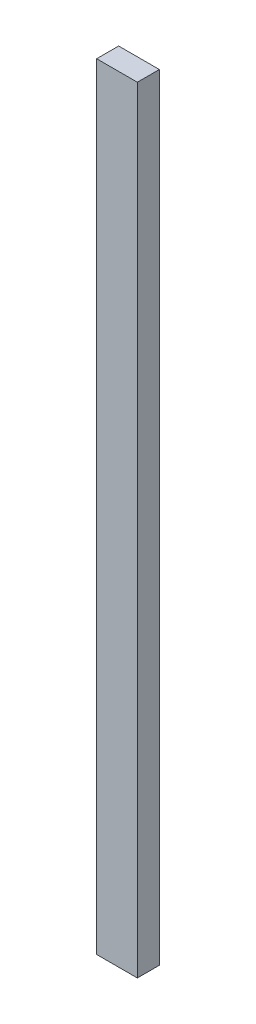
ISO-10303-21;
HEADER;
FILE_DESCRIPTION(('STEP AP214'),'2;1');
FILE_NAME('part.step','',(''),(''),'','','');
FILE_SCHEMA(('AUTOMOTIVE_DESIGN { 1 0 10303 214 1 1 1 1 }'));
ENDSEC;
DATA;
#1=APPLICATION_CONTEXT('core data for automotive mechanical design processes');
#2=APPLICATION_PROTOCOL_DEFINITION('international standard','automotive_design',2000,#1);
#3=PRODUCT_CONTEXT('',#1,'mechanical');
#4=PRODUCT('Part','Part','',(#3));
#5=PRODUCT_RELATED_PRODUCT_CATEGORY('part','',(#4));
#6=PRODUCT_DEFINITION_FORMATION('','',#4);
#7=PRODUCT_DEFINITION_CONTEXT('part definition',#1,'design');
#8=PRODUCT_DEFINITION('design','',#6,#7);
#9=PRODUCT_DEFINITION_SHAPE('','',#8);
#10=(LENGTH_UNIT() NAMED_UNIT(*) SI_UNIT(.MILLI.,.METRE.));
#11=(NAMED_UNIT(*) PLANE_ANGLE_UNIT() SI_UNIT($,.RADIAN.));
#12=(NAMED_UNIT(*) SI_UNIT($,.STERADIAN.) SOLID_ANGLE_UNIT());
#13=UNCERTAINTY_MEASURE_WITH_UNIT(LENGTH_MEASURE(1.E-05),#10,'distance_accuracy_value','');
#14=(GEOMETRIC_REPRESENTATION_CONTEXT(3) GLOBAL_UNCERTAINTY_ASSIGNED_CONTEXT((#13)) GLOBAL_UNIT_ASSIGNED_CONTEXT((#10,
#11,#12)) REPRESENTATION_CONTEXT('',''));
#15=CARTESIAN_POINT('',(0.,0.,0.));
#16=DIRECTION('',(0.,0.,1.));
#17=DIRECTION('',(1.,0.,0.));
#18=AXIS2_PLACEMENT_3D('',#15,#16,#17);
#19=CARTESIAN_POINT('',(-41.4226910768773,2000.,-17.1817593212771));
#20=DIRECTION('',(1.,0.,0.));
#21=DIRECTION('',(0.,0.,-1.));
#22=AXIS2_PLACEMENT_3D('',#19,#20,#21);
#23=PLANE('',#22);
#24=DIRECTION('',(0.,0.,1.));
#25=VECTOR('',#24,1.);
#26=CARTESIAN_POINT('',(-41.4226910768773,0.,-17.1817593212771));
#27=LINE('',#26,#25);
#28=CARTESIAN_POINT('',(-41.4226910768773,0.,-17.1817593212771));
#29=VERTEX_POINT('',#28);
#30=CARTESIAN_POINT('',(-41.4226910768773,0.,39.5580040187542));
#31=VERTEX_POINT('',#30);
#32=EDGE_CURVE('E111',#29,#31,#27,.T.);
#33=ORIENTED_EDGE('',*,*,#32,.T.);
#34=DIRECTION('',(0.,-1.,0.));
#35=VECTOR('',#34,1.);
#36=CARTESIAN_POINT('',(-41.4226910768773,2000.,39.5580040187542));
#37=LINE('',#36,#35);
#38=CARTESIAN_POINT('',(-41.4226910768773,2000.,39.5580040187542));
#39=VERTEX_POINT('',#38);
#40=EDGE_CURVE('E11',#39,#31,#37,.T.);
#41=ORIENTED_EDGE('',*,*,#40,.F.);
#42=DIRECTION('',(0.,0.,1.));
#43=VECTOR('',#42,1.);
#44=CARTESIAN_POINT('',(-41.4226910768773,2000.,-17.1817593212771));
#45=LINE('',#44,#43);
#46=CARTESIAN_POINT('',(-41.4226910768773,2000.,-17.1817593212771));
#47=VERTEX_POINT('',#46);
#48=EDGE_CURVE('E95',#47,#39,#45,.T.);
#49=ORIENTED_EDGE('',*,*,#48,.F.);
#50=DIRECTION('',(0.,-1.,0.));
#51=VECTOR('',#50,1.);
#52=CARTESIAN_POINT('',(-41.4226910768773,2000.,-17.1817593212771));
#53=LINE('',#52,#51);
#54=EDGE_CURVE('E107',#47,#29,#53,.T.);
#55=ORIENTED_EDGE('',*,*,#54,.T.);
#56=EDGE_LOOP('',(#33,#41,#49,#55));
#57=FACE_BOUND('',#56,.T.);
#58=ADVANCED_FACE('F43',(#57),#23,.F.);
#59=CARTESIAN_POINT('',(-41.4226910768773,2000.,39.5580040187542));
#60=DIRECTION('',(0.,0.,-1.));
#61=DIRECTION('',(-1.,0.,0.));
#62=AXIS2_PLACEMENT_3D('',#59,#60,#61);
#63=PLANE('',#62);
#64=DIRECTION('',(1.,0.,0.));
#65=VECTOR('',#64,1.);
#66=CARTESIAN_POINT('',(-41.4226910768773,0.,39.5580040187542));
#67=LINE('',#66,#65);
#68=CARTESIAN_POINT('',(63.5325519089082,0.,39.5580040187542));
#69=VERTEX_POINT('',#68);
#70=EDGE_CURVE('E100',#31,#69,#67,.T.);
#71=ORIENTED_EDGE('',*,*,#70,.T.);
#72=DIRECTION('',(0.,-1.,0.));
#73=VECTOR('',#72,1.);
#74=CARTESIAN_POINT('',(63.5325519089082,2000.,39.5580040187542));
#75=LINE('',#74,#73);
#76=CARTESIAN_POINT('',(63.5325519089082,2000.,39.5580040187542));
#77=VERTEX_POINT('',#76);
#78=EDGE_CURVE('E52',#77,#69,#75,.T.);
#79=ORIENTED_EDGE('',*,*,#78,.F.);
#80=DIRECTION('',(1.,0.,0.));
#81=VECTOR('',#80,1.);
#82=CARTESIAN_POINT('',(-41.4226910768773,2000.,39.5580040187542));
#83=LINE('',#82,#81);
#84=EDGE_CURVE('E90',#39,#77,#83,.T.);
#85=ORIENTED_EDGE('',*,*,#84,.F.);
#86=ORIENTED_EDGE('',*,*,#40,.T.);
#87=EDGE_LOOP('',(#71,#79,#85,#86));
#88=FACE_BOUND('',#87,.T.);
#89=ADVANCED_FACE('F99',(#88),#63,.F.);
#90=CARTESIAN_POINT('',(63.5325519089082,2000.,-17.1817593212771));
#91=DIRECTION('',(-1.,0.,0.));
#92=DIRECTION('',(0.,0.,1.));
#93=AXIS2_PLACEMENT_3D('',#90,#91,#92);
#94=PLANE('',#93);
#95=DIRECTION('',(0.,0.,-1.));
#96=VECTOR('',#95,1.);
#97=CARTESIAN_POINT('',(63.5325519089082,0.,-17.1817593212771));
#98=LINE('',#97,#96);
#99=CARTESIAN_POINT('',(63.5325519089082,0.,-17.1817593212771));
#100=VERTEX_POINT('',#99);
#101=EDGE_CURVE('E77',#69,#100,#98,.T.);
#102=ORIENTED_EDGE('',*,*,#101,.T.);
#103=DIRECTION('',(0.,-1.,0.));
#104=VECTOR('',#103,1.);
#105=CARTESIAN_POINT('',(63.5325519089082,2000.,-17.1817593212771));
#106=LINE('',#105,#104);
#107=CARTESIAN_POINT('',(63.5325519089082,2000.,-17.1817593212771));
#108=VERTEX_POINT('',#107);
#109=EDGE_CURVE('E102',#108,#100,#106,.T.);
#110=ORIENTED_EDGE('',*,*,#109,.F.);
#111=DIRECTION('',(0.,0.,-1.));
#112=VECTOR('',#111,1.);
#113=CARTESIAN_POINT('',(63.5325519089082,2000.,-17.1817593212771));
#114=LINE('',#113,#112);
#115=EDGE_CURVE('E93',#77,#108,#114,.T.);
#116=ORIENTED_EDGE('',*,*,#115,.F.);
#117=ORIENTED_EDGE('',*,*,#78,.T.);
#118=EDGE_LOOP('',(#102,#110,#116,#117));
#119=FACE_BOUND('',#118,.T.);
#120=ADVANCED_FACE('F103',(#119),#94,.F.);
#121=CARTESIAN_POINT('',(-41.4226910768773,2000.,-17.1817593212771));
#122=DIRECTION('',(0.,0.,1.));
#123=DIRECTION('',(1.,0.,0.));
#124=AXIS2_PLACEMENT_3D('',#121,#122,#123);
#125=PLANE('',#124);
#126=DIRECTION('',(-1.,0.,0.));
#127=VECTOR('',#126,1.);
#128=CARTESIAN_POINT('',(-41.4226910768773,0.,-17.1817593212771));
#129=LINE('',#128,#127);
#130=EDGE_CURVE('E83',#100,#29,#129,.T.);
#131=ORIENTED_EDGE('',*,*,#130,.T.);
#132=ORIENTED_EDGE('',*,*,#54,.F.);
#133=DIRECTION('',(-1.,0.,0.));
#134=VECTOR('',#133,1.);
#135=CARTESIAN_POINT('',(-41.4226910768773,2000.,-17.1817593212771));
#136=LINE('',#135,#134);
#137=EDGE_CURVE('E60',#108,#47,#136,.T.);
#138=ORIENTED_EDGE('',*,*,#137,.F.);
#139=ORIENTED_EDGE('',*,*,#109,.T.);
#140=EDGE_LOOP('',(#131,#132,#138,#139));
#141=FACE_BOUND('',#140,.T.);
#142=ADVANCED_FACE('F124',(#141),#125,.F.);
#143=CARTESIAN_POINT('',(0.,2000.,0.));
#144=DIRECTION('',(0.,1.,0.));
#145=DIRECTION('',(0.,0.,1.));
#146=AXIS2_PLACEMENT_3D('',#143,#144,#145);
#147=PLANE('',#146);
#148=ORIENTED_EDGE('',*,*,#48,.T.);
#149=ORIENTED_EDGE('',*,*,#84,.T.);
#150=ORIENTED_EDGE('',*,*,#115,.T.);
#151=ORIENTED_EDGE('',*,*,#137,.T.);
#152=EDGE_LOOP('',(#148,#149,#150,#151));
#153=FACE_BOUND('',#152,.T.);
#154=ADVANCED_FACE('F91',(#153),#147,.T.);
#155=CARTESIAN_POINT('',(0.,0.,0.));
#156=DIRECTION('',(0.,1.,0.));
#157=DIRECTION('',(0.,0.,1.));
#158=AXIS2_PLACEMENT_3D('',#155,#156,#157);
#159=PLANE('',#158);
#160=ORIENTED_EDGE('',*,*,#32,.F.);
#161=ORIENTED_EDGE('',*,*,#130,.F.);
#162=ORIENTED_EDGE('',*,*,#101,.F.);
#163=ORIENTED_EDGE('',*,*,#70,.F.);
#164=EDGE_LOOP('',(#160,#161,#162,#163));
#165=FACE_BOUND('',#164,.T.);
#166=ADVANCED_FACE('F127',(#165),#159,.F.);
#167=CLOSED_SHELL('',(#58,#89,#120,#142,#154,#166));
#168=MANIFOLD_SOLID_BREP('B2',#167);
#169=ADVANCED_BREP_SHAPE_REPRESENTATION('',(#18,#168),#14);
#170=SHAPE_DEFINITION_REPRESENTATION(#9,#169);
ENDSEC;
END-ISO-10303-21;
